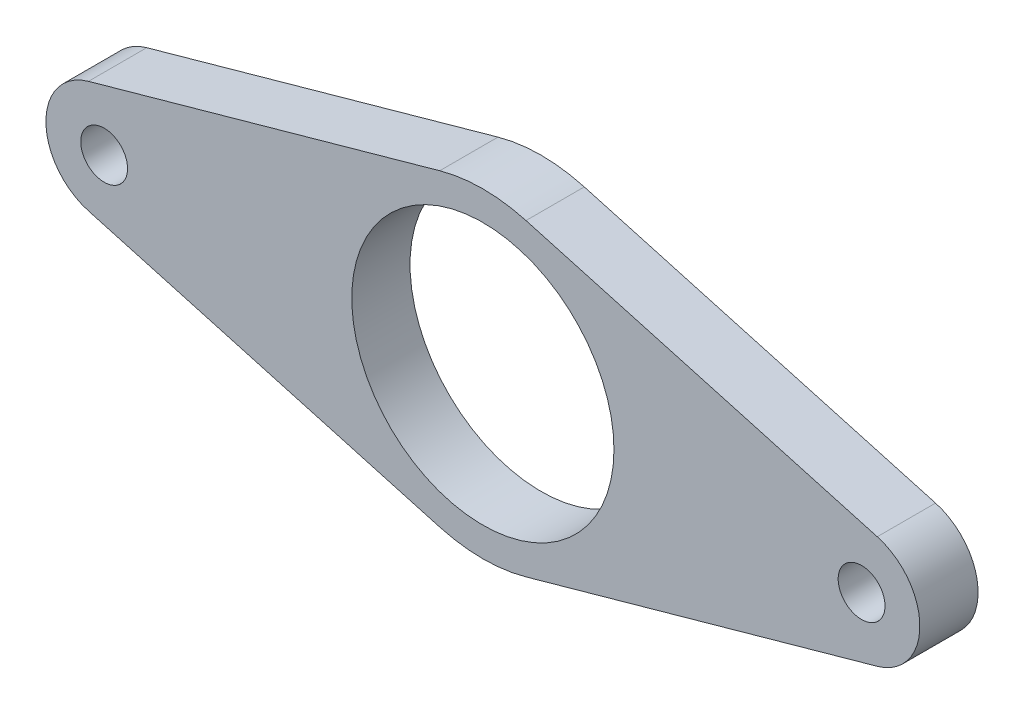
ISO-10303-21;
HEADER;
FILE_DESCRIPTION(('STEP AP214'),'2;1');
FILE_NAME('part.step','',(''),(''),'','','');
FILE_SCHEMA(('AUTOMOTIVE_DESIGN { 1 0 10303 214 1 1 1 1 }'));
ENDSEC;
DATA;
#1=APPLICATION_CONTEXT('core data for automotive mechanical design processes');
#2=APPLICATION_PROTOCOL_DEFINITION('international standard','automotive_design',2000,#1);
#3=PRODUCT_CONTEXT('',#1,'mechanical');
#4=PRODUCT('Part','Part','',(#3));
#5=PRODUCT_RELATED_PRODUCT_CATEGORY('part','',(#4));
#6=PRODUCT_DEFINITION_FORMATION('','',#4);
#7=PRODUCT_DEFINITION_CONTEXT('part definition',#1,'design');
#8=PRODUCT_DEFINITION('design','',#6,#7);
#9=PRODUCT_DEFINITION_SHAPE('','',#8);
#10=(LENGTH_UNIT() NAMED_UNIT(*) SI_UNIT(.MILLI.,.METRE.));
#11=(NAMED_UNIT(*) PLANE_ANGLE_UNIT() SI_UNIT($,.RADIAN.));
#12=(NAMED_UNIT(*) SI_UNIT($,.STERADIAN.) SOLID_ANGLE_UNIT());
#13=UNCERTAINTY_MEASURE_WITH_UNIT(LENGTH_MEASURE(1.E-05),#10,'distance_accuracy_value','');
#14=(GEOMETRIC_REPRESENTATION_CONTEXT(3) GLOBAL_UNCERTAINTY_ASSIGNED_CONTEXT((#13)) GLOBAL_UNIT_ASSIGNED_CONTEXT((#10,
#11,#12)) REPRESENTATION_CONTEXT('',''));
#15=CARTESIAN_POINT('',(0.,0.,0.));
#16=DIRECTION('',(0.,0.,1.));
#17=DIRECTION('',(1.,0.,0.));
#18=AXIS2_PLACEMENT_3D('',#15,#16,#17);
#19=CARTESIAN_POINT('',(4.70144230769231,16.8177093112421,6.35));
#20=DIRECTION('',(-0.269230769230769,-0.963075694272993,0.));
#21=DIRECTION('',(0.963075694272994,-0.269230769230769,0.));
#22=AXIS2_PLACEMENT_3D('',#19,#20,#21);
#23=PLANE('',#22);
#24=DIRECTION('',(-0.963075694272994,0.269230769230769,0.));
#25=VECTOR('',#24,1.);
#26=CARTESIAN_POINT('',(4.70144230769231,16.8177093112421,0.));
#27=LINE('',#26,#25);
#28=CARTESIAN_POINT('',(42.9846153846154,6.11553065863351,0.));
#29=VERTEX_POINT('',#28);
#30=CARTESIAN_POINT('',(4.70144230769231,16.8177093112421,0.));
#31=VERTEX_POINT('',#30);
#32=EDGE_CURVE('E156',#29,#31,#27,.T.);
#33=ORIENTED_EDGE('',*,*,#32,.T.);
#34=DIRECTION('',(0.,0.,-1.));
#35=VECTOR('',#34,1.);
#36=CARTESIAN_POINT('',(4.70144230769231,16.8177093112421,6.35));
#37=LINE('',#36,#35);
#38=CARTESIAN_POINT('',(4.70144230769231,16.8177093112421,6.35));
#39=VERTEX_POINT('',#38);
#40=EDGE_CURVE('E11',#39,#31,#37,.T.);
#41=ORIENTED_EDGE('',*,*,#40,.F.);
#42=DIRECTION('',(-0.963075694272994,0.269230769230769,0.));
#43=VECTOR('',#42,1.);
#44=CARTESIAN_POINT('',(4.70144230769231,16.8177093112421,6.35));
#45=LINE('',#44,#43);
#46=CARTESIAN_POINT('',(42.9846153846154,6.11553065863351,6.35));
#47=VERTEX_POINT('',#46);
#48=EDGE_CURVE('E223',#47,#39,#45,.T.);
#49=ORIENTED_EDGE('',*,*,#48,.F.);
#50=DIRECTION('',(0.,0.,-1.));
#51=VECTOR('',#50,1.);
#52=CARTESIAN_POINT('',(42.9846153846154,6.11553065863351,6.35));
#53=LINE('',#52,#51);
#54=EDGE_CURVE('E59',#47,#29,#53,.T.);
#55=ORIENTED_EDGE('',*,*,#54,.T.);
#56=EDGE_LOOP('',(#33,#41,#49,#55));
#57=FACE_BOUND('',#56,.T.);
#58=ADVANCED_FACE('F41',(#57),#23,.F.);
#59=CARTESIAN_POINT('',(0.,0.,6.35));
#60=DIRECTION('',(0.,0.,-1.));
#61=DIRECTION('',(-1.,0.,0.));
#62=AXIS2_PLACEMENT_3D('',#59,#60,#61);
#63=CYLINDRICAL_SURFACE('',#62,17.4625);
#64=CARTESIAN_POINT('',(0.,0.,0.));
#65=DIRECTION('',(0.,0.,1.));
#66=DIRECTION('',(1.,0.,0.));
#67=AXIS2_PLACEMENT_3D('',#64,#65,#66);
#68=CIRCLE('',#67,17.4625);
#69=CARTESIAN_POINT('',(-4.70144230769231,16.8177093112422,0.));
#70=VERTEX_POINT('',#69);
#71=EDGE_CURVE('E159',#31,#70,#68,.T.);
#72=ORIENTED_EDGE('',*,*,#71,.T.);
#73=DIRECTION('',(0.,0.,-1.));
#74=VECTOR('',#73,1.);
#75=CARTESIAN_POINT('',(-4.70144230769231,16.8177093112422,6.35));
#76=LINE('',#75,#74);
#77=CARTESIAN_POINT('',(-4.70144230769231,16.8177093112422,6.35));
#78=VERTEX_POINT('',#77);
#79=EDGE_CURVE('E51',#78,#70,#76,.T.);
#80=ORIENTED_EDGE('',*,*,#79,.F.);
#81=CARTESIAN_POINT('',(0.,0.,6.35));
#82=DIRECTION('',(0.,0.,1.));
#83=DIRECTION('',(1.,0.,0.));
#84=AXIS2_PLACEMENT_3D('',#81,#82,#83);
#85=CIRCLE('',#84,17.4625);
#86=EDGE_CURVE('E97',#39,#78,#85,.T.);
#87=ORIENTED_EDGE('',*,*,#86,.F.);
#88=ORIENTED_EDGE('',*,*,#40,.T.);
#89=EDGE_LOOP('',(#72,#80,#87,#88));
#90=FACE_BOUND('',#89,.T.);
#91=ADVANCED_FACE('F202',(#90),#63,.T.);
#92=CARTESIAN_POINT('',(-4.70144230769231,16.8177093112422,6.35));
#93=DIRECTION('',(-0.269230769230769,0.963075694272993,0.));
#94=DIRECTION('',(-0.963075694272994,-0.269230769230769,0.));
#95=AXIS2_PLACEMENT_3D('',#92,#93,#94);
#96=PLANE('',#95);
#97=DIRECTION('',(0.963075694272994,0.269230769230769,0.));
#98=VECTOR('',#97,1.);
#99=CARTESIAN_POINT('',(-4.70144230769231,16.8177093112422,0.));
#100=LINE('',#99,#98);
#101=CARTESIAN_POINT('',(-42.9846153846154,6.11553065863351,0.));
#102=VERTEX_POINT('',#101);
#103=EDGE_CURVE('E163',#102,#70,#100,.T.);
#104=ORIENTED_EDGE('',*,*,#103,.F.);
#105=DIRECTION('',(0.,0.,-1.));
#106=VECTOR('',#105,1.);
#107=CARTESIAN_POINT('',(-42.9846153846154,6.11553065863351,6.35));
#108=LINE('',#107,#106);
#109=CARTESIAN_POINT('',(-42.9846153846154,6.11553065863351,6.35));
#110=VERTEX_POINT('',#109);
#111=EDGE_CURVE('E193',#110,#102,#108,.T.);
#112=ORIENTED_EDGE('',*,*,#111,.F.);
#113=DIRECTION('',(0.963075694272994,0.269230769230769,0.));
#114=VECTOR('',#113,1.);
#115=CARTESIAN_POINT('',(-4.70144230769231,16.8177093112422,6.35));
#116=LINE('',#115,#114);
#117=EDGE_CURVE('E201',#110,#78,#116,.T.);
#118=ORIENTED_EDGE('',*,*,#117,.T.);
#119=ORIENTED_EDGE('',*,*,#79,.T.);
#120=EDGE_LOOP('',(#104,#112,#118,#119));
#121=FACE_BOUND('',#120,.T.);
#122=ADVANCED_FACE('F199',(#121),#96,.T.);
#123=CARTESIAN_POINT('',(-41.275,0.,6.35));
#124=DIRECTION('',(0.,0.,-1.));
#125=DIRECTION('',(-1.,0.,0.));
#126=AXIS2_PLACEMENT_3D('',#123,#124,#125);
#127=CYLINDRICAL_SURFACE('',#126,6.35);
#128=CARTESIAN_POINT('',(-41.275,0.,0.));
#129=DIRECTION('',(0.,0.,1.));
#130=DIRECTION('',(1.,0.,0.));
#131=AXIS2_PLACEMENT_3D('',#128,#129,#130);
#132=CIRCLE('',#131,6.35);
#133=CARTESIAN_POINT('',(-42.9846153846154,-6.11553065863351,0.));
#134=VERTEX_POINT('',#133);
#135=EDGE_CURVE('E167',#102,#134,#132,.T.);
#136=ORIENTED_EDGE('',*,*,#135,.T.);
#137=DIRECTION('',(0.,0.,-1.));
#138=VECTOR('',#137,1.);
#139=CARTESIAN_POINT('',(-42.9846153846154,-6.11553065863351,6.35));
#140=LINE('',#139,#138);
#141=CARTESIAN_POINT('',(-42.9846153846154,-6.11553065863351,6.35));
#142=VERTEX_POINT('',#141);
#143=EDGE_CURVE('E189',#142,#134,#140,.T.);
#144=ORIENTED_EDGE('',*,*,#143,.F.);
#145=CARTESIAN_POINT('',(-41.275,0.,6.35));
#146=DIRECTION('',(0.,0.,1.));
#147=DIRECTION('',(1.,0.,0.));
#148=AXIS2_PLACEMENT_3D('',#145,#146,#147);
#149=CIRCLE('',#148,6.35);
#150=EDGE_CURVE('E215',#110,#142,#149,.T.);
#151=ORIENTED_EDGE('',*,*,#150,.F.);
#152=ORIENTED_EDGE('',*,*,#111,.T.);
#153=EDGE_LOOP('',(#136,#144,#151,#152));
#154=FACE_BOUND('',#153,.T.);
#155=ADVANCED_FACE('F210',(#154),#127,.T.);
#156=CARTESIAN_POINT('',(-4.70144230769231,-16.8177093112422,6.35));
#157=DIRECTION('',(0.269230769230769,0.963075694272993,0.));
#158=DIRECTION('',(-0.963075694272994,0.269230769230769,0.));
#159=AXIS2_PLACEMENT_3D('',#156,#157,#158);
#160=PLANE('',#159);
#161=DIRECTION('',(0.963075694272994,-0.269230769230769,0.));
#162=VECTOR('',#161,1.);
#163=CARTESIAN_POINT('',(-4.70144230769231,-16.8177093112422,0.));
#164=LINE('',#163,#162);
#165=CARTESIAN_POINT('',(-4.70144230769231,-16.8177093112422,0.));
#166=VERTEX_POINT('',#165);
#167=EDGE_CURVE('E170',#134,#166,#164,.T.);
#168=ORIENTED_EDGE('',*,*,#167,.T.);
#169=DIRECTION('',(0.,0.,-1.));
#170=VECTOR('',#169,1.);
#171=CARTESIAN_POINT('',(-4.70144230769231,-16.8177093112422,6.35));
#172=LINE('',#171,#170);
#173=CARTESIAN_POINT('',(-4.70144230769231,-16.8177093112422,6.35));
#174=VERTEX_POINT('',#173);
#175=EDGE_CURVE('E134',#174,#166,#172,.T.);
#176=ORIENTED_EDGE('',*,*,#175,.F.);
#177=DIRECTION('',(0.963075694272994,-0.269230769230769,0.));
#178=VECTOR('',#177,1.);
#179=CARTESIAN_POINT('',(-4.70144230769231,-16.8177093112422,6.35));
#180=LINE('',#179,#178);
#181=EDGE_CURVE('E120',#142,#174,#180,.T.);
#182=ORIENTED_EDGE('',*,*,#181,.F.);
#183=ORIENTED_EDGE('',*,*,#143,.T.);
#184=EDGE_LOOP('',(#168,#176,#182,#183));
#185=FACE_BOUND('',#184,.T.);
#186=ADVANCED_FACE('F213',(#185),#160,.F.);
#187=CARTESIAN_POINT('',(0.,0.,6.35));
#188=DIRECTION('',(0.,0.,-1.));
#189=DIRECTION('',(-1.,0.,0.));
#190=AXIS2_PLACEMENT_3D('',#187,#188,#189);
#191=CYLINDRICAL_SURFACE('',#190,17.4625);
#192=CARTESIAN_POINT('',(0.,0.,0.));
#193=DIRECTION('',(0.,0.,1.));
#194=DIRECTION('',(1.,0.,0.));
#195=AXIS2_PLACEMENT_3D('',#192,#193,#194);
#196=CIRCLE('',#195,17.4625);
#197=CARTESIAN_POINT('',(4.70144230769231,-16.8177093112421,0.));
#198=VERTEX_POINT('',#197);
#199=EDGE_CURVE('E130',#166,#198,#196,.T.);
#200=ORIENTED_EDGE('',*,*,#199,.T.);
#201=DIRECTION('',(0.,0.,-1.));
#202=VECTOR('',#201,1.);
#203=CARTESIAN_POINT('',(4.70144230769231,-16.8177093112421,6.35));
#204=LINE('',#203,#202);
#205=CARTESIAN_POINT('',(4.70144230769231,-16.8177093112421,6.35));
#206=VERTEX_POINT('',#205);
#207=EDGE_CURVE('E127',#206,#198,#204,.T.);
#208=ORIENTED_EDGE('',*,*,#207,.F.);
#209=CARTESIAN_POINT('',(0.,0.,6.35));
#210=DIRECTION('',(0.,0.,1.));
#211=DIRECTION('',(1.,0.,0.));
#212=AXIS2_PLACEMENT_3D('',#209,#210,#211);
#213=CIRCLE('',#212,17.4625);
#214=EDGE_CURVE('E113',#174,#206,#213,.T.);
#215=ORIENTED_EDGE('',*,*,#214,.F.);
#216=ORIENTED_EDGE('',*,*,#175,.T.);
#217=EDGE_LOOP('',(#200,#208,#215,#216));
#218=FACE_BOUND('',#217,.T.);
#219=ADVANCED_FACE('F128',(#218),#191,.T.);
#220=CARTESIAN_POINT('',(4.70144230769231,-16.8177093112421,6.35));
#221=DIRECTION('',(0.269230769230769,-0.963075694272993,0.));
#222=DIRECTION('',(0.963075694272994,0.269230769230769,0.));
#223=AXIS2_PLACEMENT_3D('',#220,#221,#222);
#224=PLANE('',#223);
#225=DIRECTION('',(-0.963075694272994,-0.269230769230769,0.));
#226=VECTOR('',#225,1.);
#227=CARTESIAN_POINT('',(4.70144230769231,-16.8177093112421,0.));
#228=LINE('',#227,#226);
#229=CARTESIAN_POINT('',(42.9846153846154,-6.11553065863351,0.));
#230=VERTEX_POINT('',#229);
#231=EDGE_CURVE('E175',#230,#198,#228,.T.);
#232=ORIENTED_EDGE('',*,*,#231,.F.);
#233=DIRECTION('',(0.,0.,-1.));
#234=VECTOR('',#233,1.);
#235=CARTESIAN_POINT('',(42.9846153846154,-6.11553065863351,6.35));
#236=LINE('',#235,#234);
#237=CARTESIAN_POINT('',(42.9846153846154,-6.11553065863351,6.35));
#238=VERTEX_POINT('',#237);
#239=EDGE_CURVE('E85',#238,#230,#236,.T.);
#240=ORIENTED_EDGE('',*,*,#239,.F.);
#241=DIRECTION('',(-0.963075694272994,-0.269230769230769,0.));
#242=VECTOR('',#241,1.);
#243=CARTESIAN_POINT('',(4.70144230769231,-16.8177093112421,6.35));
#244=LINE('',#243,#242);
#245=EDGE_CURVE('E118',#238,#206,#244,.T.);
#246=ORIENTED_EDGE('',*,*,#245,.T.);
#247=ORIENTED_EDGE('',*,*,#207,.T.);
#248=EDGE_LOOP('',(#232,#240,#246,#247));
#249=FACE_BOUND('',#248,.T.);
#250=ADVANCED_FACE('F136',(#249),#224,.T.);
#251=CARTESIAN_POINT('',(0.,0.,6.35));
#252=DIRECTION('',(0.,0.,-1.));
#253=DIRECTION('',(-1.,0.,0.));
#254=AXIS2_PLACEMENT_3D('',#251,#252,#253);
#255=CYLINDRICAL_SURFACE('',#254,14.2875);
#256=CARTESIAN_POINT('',(0.,0.,6.35));
#257=DIRECTION('',(0.,0.,1.));
#258=DIRECTION('',(1.,0.,0.));
#259=AXIS2_PLACEMENT_3D('',#256,#257,#258);
#260=CIRCLE('',#259,14.2875);
#261=CARTESIAN_POINT('',(14.2875,0.,6.35));
#262=VERTEX_POINT('',#261);
#263=EDGE_CURVE('E226',#262,#262,#260,.T.);
#264=ORIENTED_EDGE('',*,*,#263,.T.);
#265=EDGE_LOOP('',(#264));
#266=FACE_BOUND('',#265,.T.);
#267=CARTESIAN_POINT('',(0.,0.,0.));
#268=DIRECTION('',(0.,0.,1.));
#269=DIRECTION('',(1.,0.,0.));
#270=AXIS2_PLACEMENT_3D('',#267,#268,#269);
#271=CIRCLE('',#270,14.2875);
#272=CARTESIAN_POINT('',(14.2875,0.,0.));
#273=VERTEX_POINT('',#272);
#274=EDGE_CURVE('E152',#273,#273,#271,.T.);
#275=ORIENTED_EDGE('',*,*,#274,.F.);
#276=EDGE_LOOP('',(#275));
#277=FACE_BOUND('',#276,.T.);
#278=ADVANCED_FACE('F248',(#266,#277),#255,.F.);
#279=CARTESIAN_POINT('',(41.275,0.,6.35));
#280=DIRECTION('',(0.,0.,-1.));
#281=DIRECTION('',(-1.,0.,0.));
#282=AXIS2_PLACEMENT_3D('',#279,#280,#281);
#283=CYLINDRICAL_SURFACE('',#282,2.5527);
#284=CARTESIAN_POINT('',(41.275,0.,6.35));
#285=DIRECTION('',(0.,0.,1.));
#286=DIRECTION('',(1.,0.,0.));
#287=AXIS2_PLACEMENT_3D('',#284,#285,#286);
#288=CIRCLE('',#287,2.5527);
#289=CARTESIAN_POINT('',(43.8277,0.,6.35));
#290=VERTEX_POINT('',#289);
#291=EDGE_CURVE('E230',#290,#290,#288,.T.);
#292=ORIENTED_EDGE('',*,*,#291,.T.);
#293=EDGE_LOOP('',(#292));
#294=FACE_BOUND('',#293,.T.);
#295=CARTESIAN_POINT('',(41.275,0.,0.));
#296=DIRECTION('',(0.,0.,1.));
#297=DIRECTION('',(1.,0.,0.));
#298=AXIS2_PLACEMENT_3D('',#295,#296,#297);
#299=CIRCLE('',#298,2.5527);
#300=CARTESIAN_POINT('',(43.8277,0.,0.));
#301=VERTEX_POINT('',#300);
#302=EDGE_CURVE('E148',#301,#301,#299,.T.);
#303=ORIENTED_EDGE('',*,*,#302,.F.);
#304=EDGE_LOOP('',(#303));
#305=FACE_BOUND('',#304,.T.);
#306=ADVANCED_FACE('F251',(#294,#305),#283,.F.);
#307=CARTESIAN_POINT('',(-41.275,0.,6.35));
#308=DIRECTION('',(0.,0.,-1.));
#309=DIRECTION('',(-1.,0.,0.));
#310=AXIS2_PLACEMENT_3D('',#307,#308,#309);
#311=CYLINDRICAL_SURFACE('',#310,2.5527);
#312=CARTESIAN_POINT('',(-41.275,0.,6.35));
#313=DIRECTION('',(0.,0.,1.));
#314=DIRECTION('',(1.,0.,0.));
#315=AXIS2_PLACEMENT_3D('',#312,#313,#314);
#316=CIRCLE('',#315,2.5527);
#317=CARTESIAN_POINT('',(-38.7223,0.,6.35));
#318=VERTEX_POINT('',#317);
#319=EDGE_CURVE('E182',#318,#318,#316,.T.);
#320=ORIENTED_EDGE('',*,*,#319,.T.);
#321=EDGE_LOOP('',(#320));
#322=FACE_BOUND('',#321,.T.);
#323=CARTESIAN_POINT('',(-41.275,0.,0.));
#324=DIRECTION('',(0.,0.,1.));
#325=DIRECTION('',(1.,0.,0.));
#326=AXIS2_PLACEMENT_3D('',#323,#324,#325);
#327=CIRCLE('',#326,2.5527);
#328=CARTESIAN_POINT('',(-38.7223,0.,0.));
#329=VERTEX_POINT('',#328);
#330=EDGE_CURVE('E144',#329,#329,#327,.T.);
#331=ORIENTED_EDGE('',*,*,#330,.F.);
#332=EDGE_LOOP('',(#331));
#333=FACE_BOUND('',#332,.T.);
#334=ADVANCED_FACE('F43',(#322,#333),#311,.F.);
#335=CARTESIAN_POINT('',(41.275,0.,6.35));
#336=DIRECTION('',(0.,0.,-1.));
#337=DIRECTION('',(-1.,0.,0.));
#338=AXIS2_PLACEMENT_3D('',#335,#336,#337);
#339=CYLINDRICAL_SURFACE('',#338,6.35);
#340=CARTESIAN_POINT('',(41.275,0.,0.));
#341=DIRECTION('',(0.,0.,1.));
#342=DIRECTION('',(1.,0.,0.));
#343=AXIS2_PLACEMENT_3D('',#340,#341,#342);
#344=CIRCLE('',#343,6.35);
#345=EDGE_CURVE('E178',#29,#230,#344,.F.);
#346=ORIENTED_EDGE('',*,*,#345,.F.);
#347=ORIENTED_EDGE('',*,*,#54,.F.);
#348=CARTESIAN_POINT('',(41.275,0.,6.35));
#349=DIRECTION('',(0.,0.,1.));
#350=DIRECTION('',(1.,0.,0.));
#351=AXIS2_PLACEMENT_3D('',#348,#349,#350);
#352=CIRCLE('',#351,6.35);
#353=EDGE_CURVE('E138',#47,#238,#352,.F.);
#354=ORIENTED_EDGE('',*,*,#353,.T.);
#355=ORIENTED_EDGE('',*,*,#239,.T.);
#356=EDGE_LOOP('',(#346,#347,#354,#355));
#357=FACE_BOUND('',#356,.T.);
#358=ADVANCED_FACE('F242',(#357),#339,.T.);
#359=CARTESIAN_POINT('',(0.,0.,6.35));
#360=DIRECTION('',(0.,0.,1.));
#361=DIRECTION('',(1.,0.,0.));
#362=AXIS2_PLACEMENT_3D('',#359,#360,#361);
#363=PLANE('',#362);
#364=ORIENTED_EDGE('',*,*,#319,.F.);
#365=EDGE_LOOP('',(#364));
#366=FACE_BOUND('',#365,.T.);
#367=ORIENTED_EDGE('',*,*,#291,.F.);
#368=EDGE_LOOP('',(#367));
#369=FACE_BOUND('',#368,.T.);
#370=ORIENTED_EDGE('',*,*,#263,.F.);
#371=EDGE_LOOP('',(#370));
#372=FACE_BOUND('',#371,.T.);
#373=ORIENTED_EDGE('',*,*,#48,.T.);
#374=ORIENTED_EDGE('',*,*,#86,.T.);
#375=ORIENTED_EDGE('',*,*,#117,.F.);
#376=ORIENTED_EDGE('',*,*,#150,.T.);
#377=ORIENTED_EDGE('',*,*,#181,.T.);
#378=ORIENTED_EDGE('',*,*,#214,.T.);
#379=ORIENTED_EDGE('',*,*,#245,.F.);
#380=ORIENTED_EDGE('',*,*,#353,.F.);
#381=EDGE_LOOP('',(#373,#374,#375,#376,#377,#378,#379,#380));
#382=FACE_BOUND('',#381,.T.);
#383=ADVANCED_FACE('F115',(#366,#369,#372,#382),#363,.T.);
#384=CARTESIAN_POINT('',(0.,0.,0.));
#385=DIRECTION('',(0.,0.,1.));
#386=DIRECTION('',(1.,0.,0.));
#387=AXIS2_PLACEMENT_3D('',#384,#385,#386);
#388=PLANE('',#387);
#389=ORIENTED_EDGE('',*,*,#330,.T.);
#390=EDGE_LOOP('',(#389));
#391=FACE_BOUND('',#390,.T.);
#392=ORIENTED_EDGE('',*,*,#302,.T.);
#393=EDGE_LOOP('',(#392));
#394=FACE_BOUND('',#393,.T.);
#395=ORIENTED_EDGE('',*,*,#274,.T.);
#396=EDGE_LOOP('',(#395));
#397=FACE_BOUND('',#396,.T.);
#398=ORIENTED_EDGE('',*,*,#32,.F.);
#399=ORIENTED_EDGE('',*,*,#345,.T.);
#400=ORIENTED_EDGE('',*,*,#231,.T.);
#401=ORIENTED_EDGE('',*,*,#199,.F.);
#402=ORIENTED_EDGE('',*,*,#167,.F.);
#403=ORIENTED_EDGE('',*,*,#135,.F.);
#404=ORIENTED_EDGE('',*,*,#103,.T.);
#405=ORIENTED_EDGE('',*,*,#71,.F.);
#406=EDGE_LOOP('',(#398,#399,#400,#401,#402,#403,#404,#405));
#407=FACE_BOUND('',#406,.T.);
#408=ADVANCED_FACE('F206',(#391,#394,#397,#407),#388,.F.);
#409=CLOSED_SHELL('',(#58,#91,#122,#155,#186,#219,#250,#278,#306,#334,#358,#383,#408));
#410=MANIFOLD_SOLID_BREP('B2',#409);
#411=ADVANCED_BREP_SHAPE_REPRESENTATION('',(#18,#410),#14);
#412=SHAPE_DEFINITION_REPRESENTATION(#9,#411);
ENDSEC;
END-ISO-10303-21;
